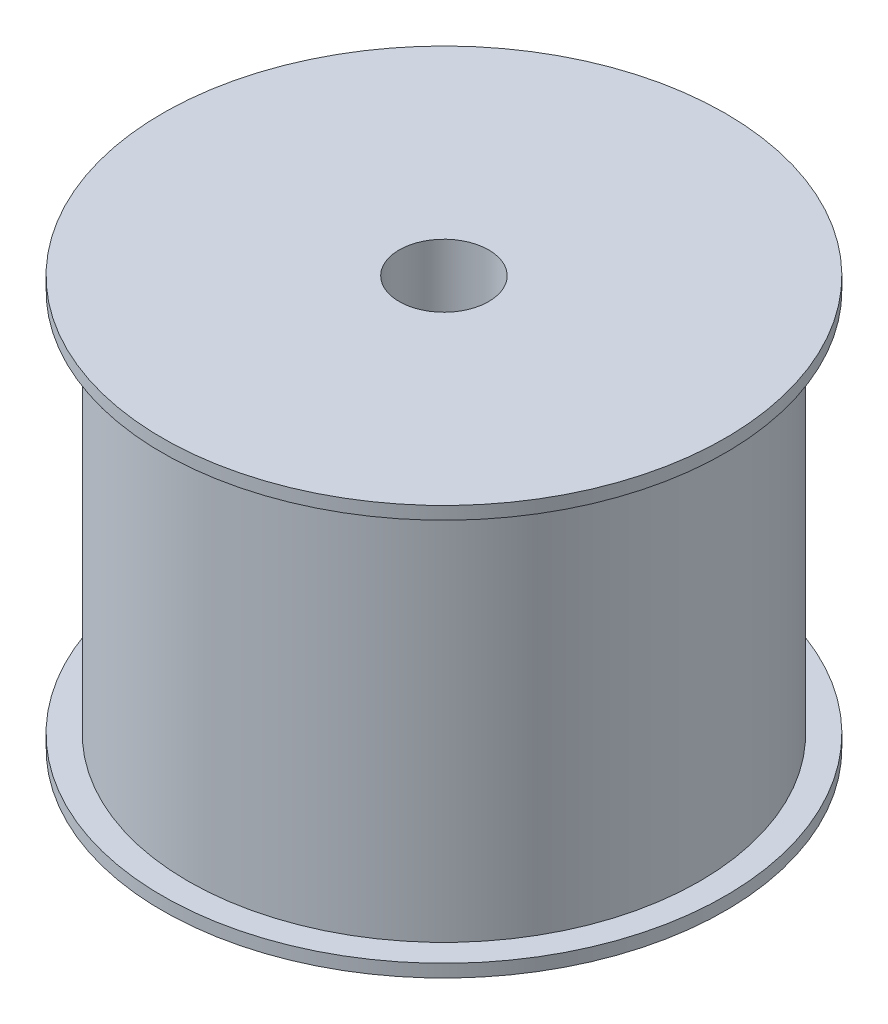
ISO-10303-21;
HEADER;
FILE_DESCRIPTION(('STEP AP214'),'2;1');
FILE_NAME('part.step','',(''),(''),'','','');
FILE_SCHEMA(('AUTOMOTIVE_DESIGN { 1 0 10303 214 1 1 1 1 }'));
ENDSEC;
DATA;
#1=APPLICATION_CONTEXT('core data for automotive mechanical design processes');
#2=APPLICATION_PROTOCOL_DEFINITION('international standard','automotive_design',2000,#1);
#3=PRODUCT_CONTEXT('',#1,'mechanical');
#4=PRODUCT('Part','Part','',(#3));
#5=PRODUCT_RELATED_PRODUCT_CATEGORY('part','',(#4));
#6=PRODUCT_DEFINITION_FORMATION('','',#4);
#7=PRODUCT_DEFINITION_CONTEXT('part definition',#1,'design');
#8=PRODUCT_DEFINITION('design','',#6,#7);
#9=PRODUCT_DEFINITION_SHAPE('','',#8);
#10=(LENGTH_UNIT() NAMED_UNIT(*) SI_UNIT(.MILLI.,.METRE.));
#11=(NAMED_UNIT(*) PLANE_ANGLE_UNIT() SI_UNIT($,.RADIAN.));
#12=(NAMED_UNIT(*) SI_UNIT($,.STERADIAN.) SOLID_ANGLE_UNIT());
#13=UNCERTAINTY_MEASURE_WITH_UNIT(LENGTH_MEASURE(1.E-05),#10,'distance_accuracy_value','');
#14=(GEOMETRIC_REPRESENTATION_CONTEXT(3) GLOBAL_UNCERTAINTY_ASSIGNED_CONTEXT((#13)) GLOBAL_UNIT_ASSIGNED_CONTEXT((#10,
#11,#12)) REPRESENTATION_CONTEXT('',''));
#15=CARTESIAN_POINT('',(0.,0.,0.));
#16=DIRECTION('',(0.,0.,1.));
#17=DIRECTION('',(1.,0.,0.));
#18=AXIS2_PLACEMENT_3D('',#15,#16,#17);
#19=CARTESIAN_POINT('',(0.,0.,0.));
#20=DIRECTION('',(0.,-1.,0.));
#21=DIRECTION('',(0.,0.,-1.));
#22=AXIS2_PLACEMENT_3D('',#19,#20,#21);
#23=CYLINDRICAL_SURFACE('',#22,2.75);
#24=CARTESIAN_POINT('',(0.,-6.97916666666668,0.));
#25=DIRECTION('',(0.,-1.,0.));
#26=DIRECTION('',(0.,0.,-1.));
#27=AXIS2_PLACEMENT_3D('',#24,#25,#26);
#28=CIRCLE('',#27,2.75);
#29=CARTESIAN_POINT('',(0.,-6.97916666666668,-2.75));
#30=VERTEX_POINT('',#29);
#31=EDGE_CURVE('E10',#30,#30,#28,.T.);
#32=ORIENTED_EDGE('',*,*,#31,.T.);
#33=EDGE_LOOP('',(#32));
#34=FACE_BOUND('',#33,.T.);
#35=CARTESIAN_POINT('',(0.,6.52083333333332,0.));
#36=DIRECTION('',(0.,-1.,0.));
#37=DIRECTION('',(0.,0.,-1.));
#38=AXIS2_PLACEMENT_3D('',#35,#36,#37);
#39=CIRCLE('',#38,2.75);
#40=CARTESIAN_POINT('',(0.,6.52083333333332,-2.75));
#41=VERTEX_POINT('',#40);
#42=EDGE_CURVE('E71',#41,#41,#39,.T.);
#43=ORIENTED_EDGE('',*,*,#42,.F.);
#44=EDGE_LOOP('',(#43));
#45=FACE_BOUND('',#44,.T.);
#46=ADVANCED_FACE('F37',(#34,#45),#23,.F.);
#47=CARTESIAN_POINT('',(11.,-6.97916666666668,0.));
#48=DIRECTION('',(0.,-1.,0.));
#49=DIRECTION('',(0.,0.,-1.));
#50=AXIS2_PLACEMENT_3D('',#47,#48,#49);
#51=PLANE('',#50);
#52=CARTESIAN_POINT('',(0.,-6.97916666666668,0.));
#53=DIRECTION('',(0.,-1.,0.));
#54=DIRECTION('',(0.,0.,-1.));
#55=AXIS2_PLACEMENT_3D('',#52,#53,#54);
#56=CIRCLE('',#55,11.);
#57=CARTESIAN_POINT('',(0.,-6.97916666666668,-11.));
#58=VERTEX_POINT('',#57);
#59=EDGE_CURVE('E43',#58,#58,#56,.T.);
#60=ORIENTED_EDGE('',*,*,#59,.T.);
#61=EDGE_LOOP('',(#60));
#62=FACE_BOUND('',#61,.T.);
#63=ORIENTED_EDGE('',*,*,#31,.F.);
#64=EDGE_LOOP('',(#63));
#65=FACE_BOUND('',#64,.T.);
#66=ADVANCED_FACE('F79',(#62,#65),#51,.T.);
#67=CARTESIAN_POINT('',(0.,0.,0.));
#68=DIRECTION('',(0.,-1.,0.));
#69=DIRECTION('',(0.,0.,-1.));
#70=AXIS2_PLACEMENT_3D('',#67,#68,#69);
#71=CYLINDRICAL_SURFACE('',#70,11.);
#72=CARTESIAN_POINT('',(0.,-6.47916666666668,0.));
#73=DIRECTION('',(0.,-1.,0.));
#74=DIRECTION('',(0.,0.,-1.));
#75=AXIS2_PLACEMENT_3D('',#72,#73,#74);
#76=CIRCLE('',#75,11.);
#77=CARTESIAN_POINT('',(0.,-6.47916666666668,-11.));
#78=VERTEX_POINT('',#77);
#79=EDGE_CURVE('E47',#78,#78,#76,.T.);
#80=ORIENTED_EDGE('',*,*,#79,.T.);
#81=EDGE_LOOP('',(#80));
#82=FACE_BOUND('',#81,.T.);
#83=ORIENTED_EDGE('',*,*,#59,.F.);
#84=EDGE_LOOP('',(#83));
#85=FACE_BOUND('',#84,.T.);
#86=ADVANCED_FACE('F83',(#82,#85),#71,.T.);
#87=CARTESIAN_POINT('',(10.,-6.47916666666667,0.));
#88=DIRECTION('',(0.,1.,0.));
#89=DIRECTION('',(0.,0.,1.));
#90=AXIS2_PLACEMENT_3D('',#87,#88,#89);
#91=PLANE('',#90);
#92=CARTESIAN_POINT('',(0.,-6.47916666666667,0.));
#93=DIRECTION('',(0.,-1.,0.));
#94=DIRECTION('',(0.,0.,-1.));
#95=AXIS2_PLACEMENT_3D('',#92,#93,#94);
#96=CIRCLE('',#95,10.);
#97=CARTESIAN_POINT('',(0.,-6.47916666666667,-10.));
#98=VERTEX_POINT('',#97);
#99=EDGE_CURVE('E51',#98,#98,#96,.T.);
#100=ORIENTED_EDGE('',*,*,#99,.T.);
#101=EDGE_LOOP('',(#100));
#102=FACE_BOUND('',#101,.T.);
#103=ORIENTED_EDGE('',*,*,#79,.F.);
#104=EDGE_LOOP('',(#103));
#105=FACE_BOUND('',#104,.T.);
#106=ADVANCED_FACE('F87',(#102,#105),#91,.T.);
#107=CARTESIAN_POINT('',(0.,0.,0.));
#108=DIRECTION('',(0.,-1.,0.));
#109=DIRECTION('',(0.,0.,-1.));
#110=AXIS2_PLACEMENT_3D('',#107,#108,#109);
#111=CYLINDRICAL_SURFACE('',#110,10.);
#112=CARTESIAN_POINT('',(0.,8.52083333333333,0.));
#113=DIRECTION('',(0.,-1.,0.));
#114=DIRECTION('',(0.,0.,-1.));
#115=AXIS2_PLACEMENT_3D('',#112,#113,#114);
#116=CIRCLE('',#115,10.);
#117=CARTESIAN_POINT('',(0.,8.52083333333333,-10.));
#118=VERTEX_POINT('',#117);
#119=EDGE_CURVE('E56',#118,#118,#116,.T.);
#120=ORIENTED_EDGE('',*,*,#119,.T.);
#121=EDGE_LOOP('',(#120));
#122=FACE_BOUND('',#121,.T.);
#123=ORIENTED_EDGE('',*,*,#99,.F.);
#124=EDGE_LOOP('',(#123));
#125=FACE_BOUND('',#124,.T.);
#126=ADVANCED_FACE('F94',(#122,#125),#111,.T.);
#127=CARTESIAN_POINT('',(11.,8.52083333333333,0.));
#128=DIRECTION('',(0.,-1.,0.));
#129=DIRECTION('',(0.,0.,-1.));
#130=AXIS2_PLACEMENT_3D('',#127,#128,#129);
#131=PLANE('',#130);
#132=CARTESIAN_POINT('',(0.,8.52083333333332,0.));
#133=DIRECTION('',(0.,-1.,0.));
#134=DIRECTION('',(0.,0.,-1.));
#135=AXIS2_PLACEMENT_3D('',#132,#133,#134);
#136=CIRCLE('',#135,11.);
#137=CARTESIAN_POINT('',(0.,8.52083333333332,-11.));
#138=VERTEX_POINT('',#137);
#139=EDGE_CURVE('E59',#138,#138,#136,.T.);
#140=ORIENTED_EDGE('',*,*,#139,.T.);
#141=EDGE_LOOP('',(#140));
#142=FACE_BOUND('',#141,.T.);
#143=ORIENTED_EDGE('',*,*,#119,.F.);
#144=EDGE_LOOP('',(#143));
#145=FACE_BOUND('',#144,.T.);
#146=ADVANCED_FACE('F98',(#142,#145),#131,.T.);
#147=CARTESIAN_POINT('',(0.,0.,0.));
#148=DIRECTION('',(0.,-1.,0.));
#149=DIRECTION('',(0.,0.,-1.));
#150=AXIS2_PLACEMENT_3D('',#147,#148,#149);
#151=CYLINDRICAL_SURFACE('',#150,11.);
#152=CARTESIAN_POINT('',(0.,9.02083333333332,0.));
#153=DIRECTION('',(0.,-1.,0.));
#154=DIRECTION('',(0.,0.,-1.));
#155=AXIS2_PLACEMENT_3D('',#152,#153,#154);
#156=CIRCLE('',#155,11.);
#157=CARTESIAN_POINT('',(0.,9.02083333333332,-11.));
#158=VERTEX_POINT('',#157);
#159=EDGE_CURVE('E62',#158,#158,#156,.T.);
#160=ORIENTED_EDGE('',*,*,#159,.T.);
#161=EDGE_LOOP('',(#160));
#162=FACE_BOUND('',#161,.T.);
#163=ORIENTED_EDGE('',*,*,#139,.F.);
#164=EDGE_LOOP('',(#163));
#165=FACE_BOUND('',#164,.T.);
#166=ADVANCED_FACE('F102',(#162,#165),#151,.T.);
#167=CARTESIAN_POINT('',(1.75,9.02083333333332,0.));
#168=DIRECTION('',(0.,1.,0.));
#169=DIRECTION('',(0.,0.,1.));
#170=AXIS2_PLACEMENT_3D('',#167,#168,#169);
#171=PLANE('',#170);
#172=CARTESIAN_POINT('',(0.,9.02083333333332,0.));
#173=DIRECTION('',(0.,-1.,0.));
#174=DIRECTION('',(0.,0.,-1.));
#175=AXIS2_PLACEMENT_3D('',#172,#173,#174);
#176=CIRCLE('',#175,1.75);
#177=CARTESIAN_POINT('',(0.,9.02083333333332,-1.75));
#178=VERTEX_POINT('',#177);
#179=EDGE_CURVE('E65',#178,#178,#176,.T.);
#180=ORIENTED_EDGE('',*,*,#179,.T.);
#181=EDGE_LOOP('',(#180));
#182=FACE_BOUND('',#181,.T.);
#183=ORIENTED_EDGE('',*,*,#159,.F.);
#184=EDGE_LOOP('',(#183));
#185=FACE_BOUND('',#184,.T.);
#186=ADVANCED_FACE('F106',(#182,#185),#171,.T.);
#187=CARTESIAN_POINT('',(0.,0.,0.));
#188=DIRECTION('',(0.,-1.,0.));
#189=DIRECTION('',(0.,0.,-1.));
#190=AXIS2_PLACEMENT_3D('',#187,#188,#189);
#191=CYLINDRICAL_SURFACE('',#190,1.75);
#192=CARTESIAN_POINT('',(0.,6.52083333333332,0.));
#193=DIRECTION('',(0.,-1.,0.));
#194=DIRECTION('',(0.,0.,-1.));
#195=AXIS2_PLACEMENT_3D('',#192,#193,#194);
#196=CIRCLE('',#195,1.75);
#197=CARTESIAN_POINT('',(0.,6.52083333333332,-1.75));
#198=VERTEX_POINT('',#197);
#199=EDGE_CURVE('E68',#198,#198,#196,.T.);
#200=ORIENTED_EDGE('',*,*,#199,.T.);
#201=EDGE_LOOP('',(#200));
#202=FACE_BOUND('',#201,.T.);
#203=ORIENTED_EDGE('',*,*,#179,.F.);
#204=EDGE_LOOP('',(#203));
#205=FACE_BOUND('',#204,.T.);
#206=ADVANCED_FACE('F110',(#202,#205),#191,.F.);
#207=CARTESIAN_POINT('',(2.75,6.52083333333332,0.));
#208=DIRECTION('',(0.,-1.,0.));
#209=DIRECTION('',(0.,0.,-1.));
#210=AXIS2_PLACEMENT_3D('',#207,#208,#209);
#211=PLANE('',#210);
#212=ORIENTED_EDGE('',*,*,#42,.T.);
#213=EDGE_LOOP('',(#212));
#214=FACE_BOUND('',#213,.T.);
#215=ORIENTED_EDGE('',*,*,#199,.F.);
#216=EDGE_LOOP('',(#215));
#217=FACE_BOUND('',#216,.T.);
#218=ADVANCED_FACE('F75',(#214,#217),#211,.T.);
#219=CLOSED_SHELL('',(#46,#66,#86,#106,#126,#146,#166,#186,#206,#218));
#220=MANIFOLD_SOLID_BREP('B2',#219);
#221=ADVANCED_BREP_SHAPE_REPRESENTATION('',(#18,#220),#14);
#222=SHAPE_DEFINITION_REPRESENTATION(#9,#221);
ENDSEC;
END-ISO-10303-21;
